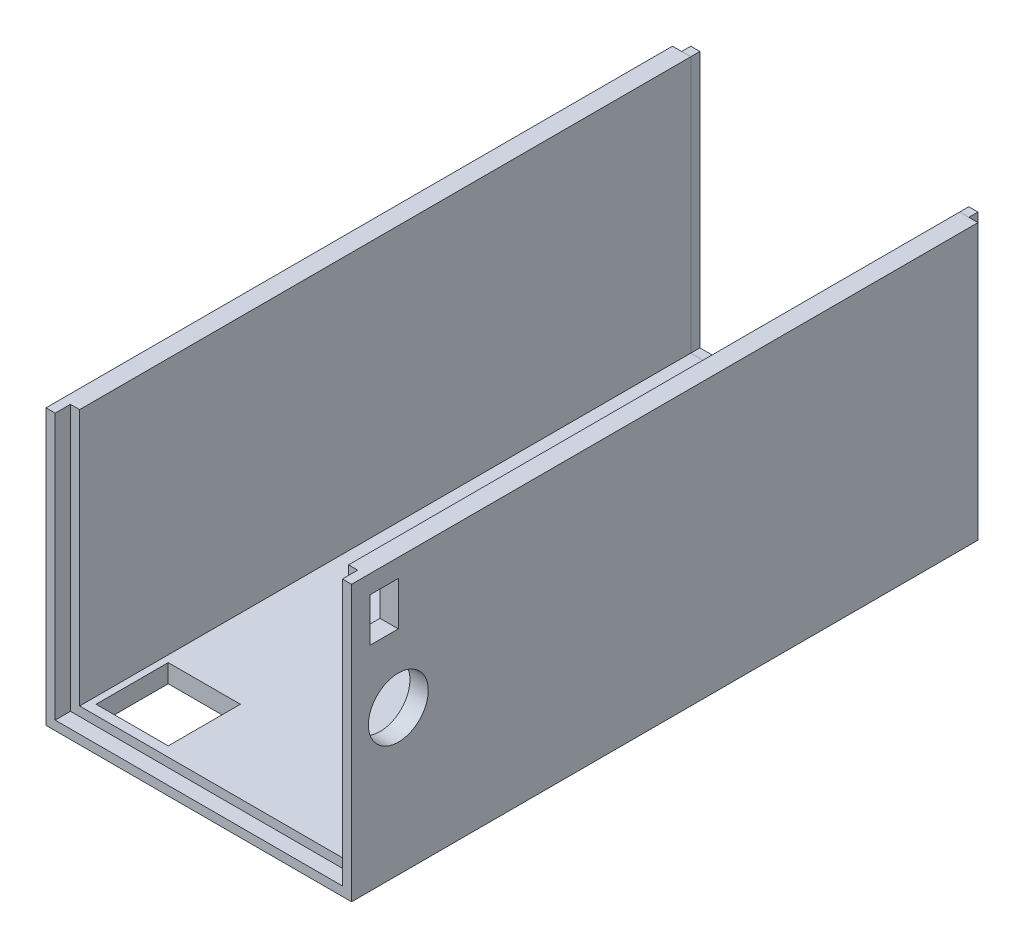
ISO-10303-21;
HEADER;
FILE_DESCRIPTION(('STEP AP214'),'2;1');
FILE_NAME('part.step','',(''),(''),'','','');
FILE_SCHEMA(('AUTOMOTIVE_DESIGN { 1 0 10303 214 1 1 1 1 }'));
ENDSEC;
DATA;
#1=APPLICATION_CONTEXT('core data for automotive mechanical design processes');
#2=APPLICATION_PROTOCOL_DEFINITION('international standard','automotive_design',2000,#1);
#3=PRODUCT_CONTEXT('',#1,'mechanical');
#4=PRODUCT('Part','Part','',(#3));
#5=PRODUCT_RELATED_PRODUCT_CATEGORY('part','',(#4));
#6=PRODUCT_DEFINITION_FORMATION('','',#4);
#7=PRODUCT_DEFINITION_CONTEXT('part definition',#1,'design');
#8=PRODUCT_DEFINITION('design','',#6,#7);
#9=PRODUCT_DEFINITION_SHAPE('','',#8);
#10=(LENGTH_UNIT() NAMED_UNIT(*) SI_UNIT(.MILLI.,.METRE.));
#11=(NAMED_UNIT(*) PLANE_ANGLE_UNIT() SI_UNIT($,.RADIAN.));
#12=(NAMED_UNIT(*) SI_UNIT($,.STERADIAN.) SOLID_ANGLE_UNIT());
#13=UNCERTAINTY_MEASURE_WITH_UNIT(LENGTH_MEASURE(1.E-05),#10,'distance_accuracy_value','');
#14=(GEOMETRIC_REPRESENTATION_CONTEXT(3) GLOBAL_UNCERTAINTY_ASSIGNED_CONTEXT((#13)) GLOBAL_UNIT_ASSIGNED_CONTEXT((#10,
#11,#12)) REPRESENTATION_CONTEXT('',''));
#15=CARTESIAN_POINT('',(0.,0.,0.));
#16=DIRECTION('',(0.,0.,1.));
#17=DIRECTION('',(1.,0.,0.));
#18=AXIS2_PLACEMENT_3D('',#15,#16,#17);
#19=CARTESIAN_POINT('',(-50.,87.,103.));
#20=DIRECTION('',(0.,-1.,0.));
#21=DIRECTION('',(1.,0.,0.));
#22=AXIS2_PLACEMENT_3D('',#19,#20,#21);
#23=PLANE('',#22);
#24=DIRECTION('',(-1.,0.,0.));
#25=VECTOR('',#24,1.);
#26=CARTESIAN_POINT('',(-50.,87.,3.));
#27=LINE('',#26,#25);
#28=CARTESIAN_POINT('',(-44.,87.,3.));
#29=VERTEX_POINT('',#28);
#30=CARTESIAN_POINT('',(-50.,87.,3.));
#31=VERTEX_POINT('',#30);
#32=EDGE_CURVE('E346',#29,#31,#27,.T.);
#33=ORIENTED_EDGE('',*,*,#32,.T.);
#34=DIRECTION('',(0.,0.,-1.));
#35=VECTOR('',#34,1.);
#36=CARTESIAN_POINT('',(-50.,87.,103.));
#37=LINE('',#36,#35);
#38=CARTESIAN_POINT('',(-50.,87.,208.));
#39=VERTEX_POINT('',#38);
#40=EDGE_CURVE('E384',#39,#31,#37,.T.);
#41=ORIENTED_EDGE('',*,*,#40,.F.);
#42=DIRECTION('',(-1.,0.,0.));
#43=VECTOR('',#42,1.);
#44=CARTESIAN_POINT('',(-50.,87.,208.));
#45=LINE('',#44,#43);
#46=CARTESIAN_POINT('',(-47.,87.,208.));
#47=VERTEX_POINT('',#46);
#48=EDGE_CURVE('E258',#47,#39,#45,.T.);
#49=ORIENTED_EDGE('',*,*,#48,.F.);
#50=DIRECTION('',(0.,0.,-1.));
#51=VECTOR('',#50,1.);
#52=CARTESIAN_POINT('',(-47.,87.,208.));
#53=LINE('',#52,#51);
#54=CARTESIAN_POINT('',(-47.,87.,203.));
#55=VERTEX_POINT('',#54);
#56=EDGE_CURVE('E261',#47,#55,#53,.T.);
#57=ORIENTED_EDGE('',*,*,#56,.T.);
#58=DIRECTION('',(-1.,0.,0.));
#59=VECTOR('',#58,1.);
#60=CARTESIAN_POINT('',(-50.,87.,203.));
#61=LINE('',#60,#59);
#62=CARTESIAN_POINT('',(-44.,87.,203.));
#63=VERTEX_POINT('',#62);
#64=EDGE_CURVE('E327',#63,#55,#61,.T.);
#65=ORIENTED_EDGE('',*,*,#64,.F.);
#66=DIRECTION('',(0.,0.,-1.));
#67=VECTOR('',#66,1.);
#68=CARTESIAN_POINT('',(-44.,87.,103.));
#69=LINE('',#68,#67);
#70=EDGE_CURVE('E363',#63,#29,#69,.T.);
#71=ORIENTED_EDGE('',*,*,#70,.T.);
#72=EDGE_LOOP('',(#33,#41,#49,#57,#65,#71));
#73=FACE_BOUND('',#72,.T.);
#74=ADVANCED_FACE('F48',(#73),#23,.F.);
#75=CARTESIAN_POINT('',(-50.,-2.99999999999999,103.));
#76=DIRECTION('',(1.,0.,0.));
#77=DIRECTION('',(0.,0.,-1.));
#78=AXIS2_PLACEMENT_3D('',#75,#76,#77);
#79=PLANE('',#78);
#80=DIRECTION('',(0.,-1.,0.));
#81=VECTOR('',#80,1.);
#82=CARTESIAN_POINT('',(-50.,-2.99999999999999,3.));
#83=LINE('',#82,#81);
#84=CARTESIAN_POINT('',(-50.,-2.99999999999999,3.));
#85=VERTEX_POINT('',#84);
#86=EDGE_CURVE('E349',#31,#85,#83,.T.);
#87=ORIENTED_EDGE('',*,*,#86,.T.);
#88=DIRECTION('',(0.,0.,-1.));
#89=VECTOR('',#88,1.);
#90=CARTESIAN_POINT('',(-50.,-2.99999999999999,103.));
#91=LINE('',#90,#89);
#92=CARTESIAN_POINT('',(-50.,-2.99999999999999,208.));
#93=VERTEX_POINT('',#92);
#94=EDGE_CURVE('E381',#93,#85,#91,.T.);
#95=ORIENTED_EDGE('',*,*,#94,.F.);
#96=DIRECTION('',(0.,-1.,0.));
#97=VECTOR('',#96,1.);
#98=CARTESIAN_POINT('',(-50.,-2.99999999999999,208.));
#99=LINE('',#98,#97);
#100=EDGE_CURVE('E240',#39,#93,#99,.T.);
#101=ORIENTED_EDGE('',*,*,#100,.F.);
#102=ORIENTED_EDGE('',*,*,#40,.T.);
#103=EDGE_LOOP('',(#87,#95,#101,#102));
#104=FACE_BOUND('',#103,.T.);
#105=ADVANCED_FACE('F424',(#104),#79,.F.);
#106=CARTESIAN_POINT('',(50.,-2.99999999999998,103.));
#107=DIRECTION('',(0.,1.,0.));
#108=DIRECTION('',(-1.,0.,0.));
#109=AXIS2_PLACEMENT_3D('',#106,#107,#108);
#110=PLANE('',#109);
#111=DIRECTION('',(-1.,0.,0.));
#112=VECTOR('',#111,1.);
#113=CARTESIAN_POINT('',(-41.8,-2.99999999999999,199.8));
#114=LINE('',#113,#112);
#115=CARTESIAN_POINT('',(-18.2,-2.99999999999999,199.8));
#116=VERTEX_POINT('',#115);
#117=CARTESIAN_POINT('',(-41.8,-2.99999999999999,199.8));
#118=VERTEX_POINT('',#117);
#119=EDGE_CURVE('E283',#116,#118,#114,.T.);
#120=ORIENTED_EDGE('',*,*,#119,.F.);
#121=DIRECTION('',(0.,0.,1.));
#122=VECTOR('',#121,1.);
#123=CARTESIAN_POINT('',(-18.2,-2.99999999999999,199.8));
#124=LINE('',#123,#122);
#125=CARTESIAN_POINT('',(-18.2,-2.99999999999999,176.2));
#126=VERTEX_POINT('',#125);
#127=EDGE_CURVE('E281',#126,#116,#124,.T.);
#128=ORIENTED_EDGE('',*,*,#127,.F.);
#129=DIRECTION('',(1.,0.,0.));
#130=VECTOR('',#129,1.);
#131=CARTESIAN_POINT('',(-41.8,-2.99999999999999,176.2));
#132=LINE('',#131,#130);
#133=CARTESIAN_POINT('',(-41.8,-2.99999999999999,176.2));
#134=VERTEX_POINT('',#133);
#135=EDGE_CURVE('E289',#134,#126,#132,.T.);
#136=ORIENTED_EDGE('',*,*,#135,.F.);
#137=DIRECTION('',(0.,0.,-1.));
#138=VECTOR('',#137,1.);
#139=CARTESIAN_POINT('',(-41.8,-2.99999999999999,199.8));
#140=LINE('',#139,#138);
#141=EDGE_CURVE('E286',#118,#134,#140,.T.);
#142=ORIENTED_EDGE('',*,*,#141,.F.);
#143=EDGE_LOOP('',(#120,#128,#136,#142));
#144=FACE_BOUND('',#143,.T.);
#145=DIRECTION('',(1.,0.,0.));
#146=VECTOR('',#145,1.);
#147=CARTESIAN_POINT('',(-6.25,-2.99999999999999,114.5));
#148=LINE('',#147,#146);
#149=CARTESIAN_POINT('',(-6.25,-2.99999999999999,114.5));
#150=VERTEX_POINT('',#149);
#151=CARTESIAN_POINT('',(6.25,-2.99999999999999,114.5));
#152=VERTEX_POINT('',#151);
#153=EDGE_CURVE('E312',#150,#152,#148,.T.);
#154=ORIENTED_EDGE('',*,*,#153,.T.);
#155=DIRECTION('',(0.,0.,-1.));
#156=VECTOR('',#155,1.);
#157=CARTESIAN_POINT('',(6.25,-2.99999999999999,114.5));
#158=LINE('',#157,#156);
#159=CARTESIAN_POINT('',(6.25,-2.99999999999999,91.5));
#160=VERTEX_POINT('',#159);
#161=EDGE_CURVE('E302',#152,#160,#158,.T.);
#162=ORIENTED_EDGE('',*,*,#161,.T.);
#163=DIRECTION('',(-1.,0.,0.));
#164=VECTOR('',#163,1.);
#165=CARTESIAN_POINT('',(-6.25,-2.99999999999999,91.5));
#166=LINE('',#165,#164);
#167=CARTESIAN_POINT('',(-6.25,-2.99999999999998,91.5));
#168=VERTEX_POINT('',#167);
#169=EDGE_CURVE('E305',#160,#168,#166,.T.);
#170=ORIENTED_EDGE('',*,*,#169,.T.);
#171=DIRECTION('',(0.,0.,1.));
#172=VECTOR('',#171,1.);
#173=CARTESIAN_POINT('',(-6.25,-2.99999999999999,114.5));
#174=LINE('',#173,#172);
#175=EDGE_CURVE('E309',#168,#150,#174,.T.);
#176=ORIENTED_EDGE('',*,*,#175,.T.);
#177=EDGE_LOOP('',(#154,#162,#170,#176));
#178=FACE_BOUND('',#177,.T.);
#179=DIRECTION('',(1.,0.,0.));
#180=VECTOR('',#179,1.);
#181=CARTESIAN_POINT('',(50.,-2.99999999999998,3.));
#182=LINE('',#181,#180);
#183=CARTESIAN_POINT('',(50.,-2.99999999999998,3.));
#184=VERTEX_POINT('',#183);
#185=EDGE_CURVE('E351',#85,#184,#182,.T.);
#186=ORIENTED_EDGE('',*,*,#185,.T.);
#187=DIRECTION('',(0.,0.,-1.));
#188=VECTOR('',#187,1.);
#189=CARTESIAN_POINT('',(50.,-2.99999999999998,103.));
#190=LINE('',#189,#188);
#191=CARTESIAN_POINT('',(50.,-2.99999999999998,208.));
#192=VERTEX_POINT('',#191);
#193=EDGE_CURVE('E378',#192,#184,#190,.T.);
#194=ORIENTED_EDGE('',*,*,#193,.F.);
#195=DIRECTION('',(1.,0.,0.));
#196=VECTOR('',#195,1.);
#197=CARTESIAN_POINT('',(50.,-2.99999999999998,208.));
#198=LINE('',#197,#196);
#199=EDGE_CURVE('E243',#93,#192,#198,.T.);
#200=ORIENTED_EDGE('',*,*,#199,.F.);
#201=ORIENTED_EDGE('',*,*,#94,.T.);
#202=EDGE_LOOP('',(#186,#194,#200,#201));
#203=FACE_BOUND('',#202,.T.);
#204=ADVANCED_FACE('F429',(#144,#178,#203),#110,.F.);
#205=CARTESIAN_POINT('',(50.,87.,103.));
#206=DIRECTION('',(-1.,0.,0.));
#207=DIRECTION('',(0.,-1.,0.));
#208=AXIS2_PLACEMENT_3D('',#205,#206,#207);
#209=PLANE('',#208);
#210=DIRECTION('',(0.,0.,-1.));
#211=VECTOR('',#210,1.);
#212=CARTESIAN_POINT('',(50.,66.7,202.));
#213=LINE('',#212,#211);
#214=CARTESIAN_POINT('',(50.,66.7,202.));
#215=VERTEX_POINT('',#214);
#216=CARTESIAN_POINT('',(50.,66.7,192.7));
#217=VERTEX_POINT('',#216);
#218=EDGE_CURVE('E220',#215,#217,#213,.T.);
#219=ORIENTED_EDGE('',*,*,#218,.F.);
#220=DIRECTION('',(0.,-1.,0.));
#221=VECTOR('',#220,1.);
#222=CARTESIAN_POINT('',(50.,81.,202.));
#223=LINE('',#222,#221);
#224=CARTESIAN_POINT('',(50.,81.,202.));
#225=VERTEX_POINT('',#224);
#226=EDGE_CURVE('E62',#225,#215,#223,.T.);
#227=ORIENTED_EDGE('',*,*,#226,.F.);
#228=DIRECTION('',(0.,0.,1.));
#229=VECTOR('',#228,1.);
#230=CARTESIAN_POINT('',(50.,81.,202.));
#231=LINE('',#230,#229);
#232=CARTESIAN_POINT('',(50.,81.,192.7));
#233=VERTEX_POINT('',#232);
#234=EDGE_CURVE('E227',#233,#225,#231,.T.);
#235=ORIENTED_EDGE('',*,*,#234,.F.);
#236=DIRECTION('',(0.,1.,0.));
#237=VECTOR('',#236,1.);
#238=CARTESIAN_POINT('',(50.,81.,192.7));
#239=LINE('',#238,#237);
#240=EDGE_CURVE('E211',#217,#233,#239,.T.);
#241=ORIENTED_EDGE('',*,*,#240,.F.);
#242=EDGE_LOOP('',(#219,#227,#235,#241));
#243=FACE_BOUND('',#242,.T.);
#244=CARTESIAN_POINT('',(50.,44.4,192.7));
#245=DIRECTION('',(1.,0.,0.));
#246=DIRECTION('',(0.,1.,0.));
#247=AXIS2_PLACEMENT_3D('',#244,#245,#246);
#248=CIRCLE('',#247,9.79999999999999);
#249=CARTESIAN_POINT('',(50.,54.2,192.7));
#250=VERTEX_POINT('',#249);
#251=EDGE_CURVE('E237',#250,#250,#248,.T.);
#252=ORIENTED_EDGE('',*,*,#251,.F.);
#253=EDGE_LOOP('',(#252));
#254=FACE_BOUND('',#253,.T.);
#255=DIRECTION('',(0.,1.,0.));
#256=VECTOR('',#255,1.);
#257=CARTESIAN_POINT('',(50.,87.,3.));
#258=LINE('',#257,#256);
#259=CARTESIAN_POINT('',(50.,87.,3.));
#260=VERTEX_POINT('',#259);
#261=EDGE_CURVE('E353',#184,#260,#258,.T.);
#262=ORIENTED_EDGE('',*,*,#261,.T.);
#263=DIRECTION('',(0.,0.,-1.));
#264=VECTOR('',#263,1.);
#265=CARTESIAN_POINT('',(50.,87.,103.));
#266=LINE('',#265,#264);
#267=CARTESIAN_POINT('',(50.,87.,208.));
#268=VERTEX_POINT('',#267);
#269=EDGE_CURVE('E375',#268,#260,#266,.T.);
#270=ORIENTED_EDGE('',*,*,#269,.F.);
#271=DIRECTION('',(0.,1.,0.));
#272=VECTOR('',#271,1.);
#273=CARTESIAN_POINT('',(50.,87.,208.));
#274=LINE('',#273,#272);
#275=EDGE_CURVE('E247',#192,#268,#274,.T.);
#276=ORIENTED_EDGE('',*,*,#275,.F.);
#277=ORIENTED_EDGE('',*,*,#193,.T.);
#278=EDGE_LOOP('',(#262,#270,#276,#277));
#279=FACE_BOUND('',#278,.T.);
#280=ADVANCED_FACE('F224',(#243,#254,#279),#209,.F.);
#281=CARTESIAN_POINT('',(44.,87.,103.));
#282=DIRECTION('',(0.,-1.,0.));
#283=DIRECTION('',(1.,0.,0.));
#284=AXIS2_PLACEMENT_3D('',#281,#282,#283);
#285=PLANE('',#284);
#286=DIRECTION('',(-1.,0.,0.));
#287=VECTOR('',#286,1.);
#288=CARTESIAN_POINT('',(44.,87.,3.));
#289=LINE('',#288,#287);
#290=CARTESIAN_POINT('',(44.,87.,3.));
#291=VERTEX_POINT('',#290);
#292=EDGE_CURVE('E355',#260,#291,#289,.T.);
#293=ORIENTED_EDGE('',*,*,#292,.T.);
#294=DIRECTION('',(0.,0.,-1.));
#295=VECTOR('',#294,1.);
#296=CARTESIAN_POINT('',(44.,87.,103.));
#297=LINE('',#296,#295);
#298=CARTESIAN_POINT('',(44.,87.,203.));
#299=VERTEX_POINT('',#298);
#300=EDGE_CURVE('E372',#299,#291,#297,.T.);
#301=ORIENTED_EDGE('',*,*,#300,.F.);
#302=DIRECTION('',(-1.,0.,0.));
#303=VECTOR('',#302,1.);
#304=CARTESIAN_POINT('',(44.,87.,203.));
#305=LINE('',#304,#303);
#306=CARTESIAN_POINT('',(47.,87.,203.));
#307=VERTEX_POINT('',#306);
#308=EDGE_CURVE('E335',#307,#299,#305,.T.);
#309=ORIENTED_EDGE('',*,*,#308,.F.);
#310=DIRECTION('',(0.,0.,-1.));
#311=VECTOR('',#310,1.);
#312=CARTESIAN_POINT('',(47.,87.,208.));
#313=LINE('',#312,#311);
#314=CARTESIAN_POINT('',(47.,87.,208.));
#315=VERTEX_POINT('',#314);
#316=EDGE_CURVE('E278',#315,#307,#313,.T.);
#317=ORIENTED_EDGE('',*,*,#316,.F.);
#318=DIRECTION('',(-1.,0.,0.));
#319=VECTOR('',#318,1.);
#320=CARTESIAN_POINT('',(47.,87.,208.));
#321=LINE('',#320,#319);
#322=EDGE_CURVE('E250',#268,#315,#321,.T.);
#323=ORIENTED_EDGE('',*,*,#322,.F.);
#324=ORIENTED_EDGE('',*,*,#269,.T.);
#325=EDGE_LOOP('',(#293,#301,#309,#317,#323,#324));
#326=FACE_BOUND('',#325,.T.);
#327=ADVANCED_FACE('F462',(#326),#285,.F.);
#328=CARTESIAN_POINT('',(44.,3.00000000000002,103.));
#329=DIRECTION('',(1.,0.,0.));
#330=DIRECTION('',(0.,1.,0.));
#331=AXIS2_PLACEMENT_3D('',#328,#329,#330);
#332=PLANE('',#331);
#333=DIRECTION('',(0.,0.,1.));
#334=VECTOR('',#333,1.);
#335=CARTESIAN_POINT('',(44.,81.,103.));
#336=LINE('',#335,#334);
#337=CARTESIAN_POINT('',(44.,81.,192.7));
#338=VERTEX_POINT('',#337);
#339=CARTESIAN_POINT('',(44.,81.,202.));
#340=VERTEX_POINT('',#339);
#341=EDGE_CURVE('E55',#338,#340,#336,.T.);
#342=ORIENTED_EDGE('',*,*,#341,.T.);
#343=DIRECTION('',(0.,-1.,0.));
#344=VECTOR('',#343,1.);
#345=CARTESIAN_POINT('',(44.,3.00000000000002,202.));
#346=LINE('',#345,#344);
#347=CARTESIAN_POINT('',(44.,66.7,202.));
#348=VERTEX_POINT('',#347);
#349=EDGE_CURVE('E12',#340,#348,#346,.T.);
#350=ORIENTED_EDGE('',*,*,#349,.T.);
#351=DIRECTION('',(0.,0.,-1.));
#352=VECTOR('',#351,1.);
#353=CARTESIAN_POINT('',(44.,66.7,103.));
#354=LINE('',#353,#352);
#355=CARTESIAN_POINT('',(44.,66.7,192.7));
#356=VERTEX_POINT('',#355);
#357=EDGE_CURVE('E399',#348,#356,#354,.T.);
#358=ORIENTED_EDGE('',*,*,#357,.T.);
#359=DIRECTION('',(0.,1.,0.));
#360=VECTOR('',#359,1.);
#361=CARTESIAN_POINT('',(44.,3.00000000000002,192.7));
#362=LINE('',#361,#360);
#363=EDGE_CURVE('E214',#356,#338,#362,.T.);
#364=ORIENTED_EDGE('',*,*,#363,.T.);
#365=EDGE_LOOP('',(#342,#350,#358,#364));
#366=FACE_BOUND('',#365,.T.);
#367=CARTESIAN_POINT('',(44.,44.4,192.7));
#368=DIRECTION('',(1.,0.,0.));
#369=DIRECTION('',(0.,1.,0.));
#370=AXIS2_PLACEMENT_3D('',#367,#368,#369);
#371=CIRCLE('',#370,9.79999999999999);
#372=CARTESIAN_POINT('',(44.,54.2,192.7));
#373=VERTEX_POINT('',#372);
#374=EDGE_CURVE('E234',#373,#373,#371,.T.);
#375=ORIENTED_EDGE('',*,*,#374,.T.);
#376=EDGE_LOOP('',(#375));
#377=FACE_BOUND('',#376,.T.);
#378=DIRECTION('',(0.,-1.,0.));
#379=VECTOR('',#378,1.);
#380=CARTESIAN_POINT('',(44.,3.00000000000002,3.));
#381=LINE('',#380,#379);
#382=CARTESIAN_POINT('',(44.,3.00000000000002,3.));
#383=VERTEX_POINT('',#382);
#384=EDGE_CURVE('E357',#291,#383,#381,.T.);
#385=ORIENTED_EDGE('',*,*,#384,.T.);
#386=DIRECTION('',(0.,0.,-1.));
#387=VECTOR('',#386,1.);
#388=CARTESIAN_POINT('',(44.,3.00000000000002,103.));
#389=LINE('',#388,#387);
#390=CARTESIAN_POINT('',(44.,3.00000000000002,203.));
#391=VERTEX_POINT('',#390);
#392=EDGE_CURVE('E369',#391,#383,#389,.T.);
#393=ORIENTED_EDGE('',*,*,#392,.F.);
#394=DIRECTION('',(0.,-1.,0.));
#395=VECTOR('',#394,1.);
#396=CARTESIAN_POINT('',(44.,3.00000000000002,203.));
#397=LINE('',#396,#395);
#398=EDGE_CURVE('E337',#299,#391,#397,.T.);
#399=ORIENTED_EDGE('',*,*,#398,.F.);
#400=ORIENTED_EDGE('',*,*,#300,.T.);
#401=EDGE_LOOP('',(#385,#393,#399,#400));
#402=FACE_BOUND('',#401,.T.);
#403=ADVANCED_FACE('F405',(#366,#377,#402),#332,.F.);
#404=CARTESIAN_POINT('',(-44.,3.,103.));
#405=DIRECTION('',(0.,-1.,0.));
#406=DIRECTION('',(1.,0.,0.));
#407=AXIS2_PLACEMENT_3D('',#404,#405,#406);
#408=PLANE('',#407);
#409=DIRECTION('',(1.,0.,0.));
#410=VECTOR('',#409,1.);
#411=CARTESIAN_POINT('',(-44.,3.,176.2));
#412=LINE('',#411,#410);
#413=CARTESIAN_POINT('',(-41.8,3.,176.2));
#414=VERTEX_POINT('',#413);
#415=CARTESIAN_POINT('',(-18.2,3.00000000000001,176.2));
#416=VERTEX_POINT('',#415);
#417=EDGE_CURVE('E393',#414,#416,#412,.T.);
#418=ORIENTED_EDGE('',*,*,#417,.T.);
#419=DIRECTION('',(0.,0.,1.));
#420=VECTOR('',#419,1.);
#421=CARTESIAN_POINT('',(-18.2,3.00000000000001,103.));
#422=LINE('',#421,#420);
#423=CARTESIAN_POINT('',(-18.2,3.00000000000001,199.8));
#424=VERTEX_POINT('',#423);
#425=EDGE_CURVE('E396',#416,#424,#422,.T.);
#426=ORIENTED_EDGE('',*,*,#425,.T.);
#427=DIRECTION('',(-1.,0.,0.));
#428=VECTOR('',#427,1.);
#429=CARTESIAN_POINT('',(-44.,3.,199.8));
#430=LINE('',#429,#428);
#431=CARTESIAN_POINT('',(-41.8,3.,199.8));
#432=VERTEX_POINT('',#431);
#433=EDGE_CURVE('E387',#424,#432,#430,.T.);
#434=ORIENTED_EDGE('',*,*,#433,.T.);
#435=DIRECTION('',(0.,0.,-1.));
#436=VECTOR('',#435,1.);
#437=CARTESIAN_POINT('',(-41.8,3.,103.));
#438=LINE('',#437,#436);
#439=EDGE_CURVE('E390',#432,#414,#438,.T.);
#440=ORIENTED_EDGE('',*,*,#439,.T.);
#441=EDGE_LOOP('',(#418,#426,#434,#440));
#442=FACE_BOUND('',#441,.T.);
#443=DIRECTION('',(-1.,0.,0.));
#444=VECTOR('',#443,1.);
#445=CARTESIAN_POINT('',(-6.25,3.00000000000001,91.5));
#446=LINE('',#445,#444);
#447=CARTESIAN_POINT('',(6.25000000000001,3.00000000000001,91.5));
#448=VERTEX_POINT('',#447);
#449=CARTESIAN_POINT('',(-6.25,3.00000000000001,91.5));
#450=VERTEX_POINT('',#449);
#451=EDGE_CURVE('E317',#448,#450,#446,.T.);
#452=ORIENTED_EDGE('',*,*,#451,.F.);
#453=DIRECTION('',(0.,0.,-1.));
#454=VECTOR('',#453,1.);
#455=CARTESIAN_POINT('',(6.25,3.00000000000001,114.5));
#456=LINE('',#455,#454);
#457=CARTESIAN_POINT('',(6.25,3.00000000000001,114.5));
#458=VERTEX_POINT('',#457);
#459=EDGE_CURVE('E295',#458,#448,#456,.T.);
#460=ORIENTED_EDGE('',*,*,#459,.F.);
#461=DIRECTION('',(1.,0.,0.));
#462=VECTOR('',#461,1.);
#463=CARTESIAN_POINT('',(-6.25,3.00000000000001,114.5));
#464=LINE('',#463,#462);
#465=CARTESIAN_POINT('',(-6.25,3.00000000000001,114.5));
#466=VERTEX_POINT('',#465);
#467=EDGE_CURVE('E306',#466,#458,#464,.T.);
#468=ORIENTED_EDGE('',*,*,#467,.F.);
#469=DIRECTION('',(0.,0.,1.));
#470=VECTOR('',#469,1.);
#471=CARTESIAN_POINT('',(-6.25,3.00000000000001,114.5));
#472=LINE('',#471,#470);
#473=EDGE_CURVE('E320',#450,#466,#472,.T.);
#474=ORIENTED_EDGE('',*,*,#473,.F.);
#475=EDGE_LOOP('',(#452,#460,#468,#474));
#476=FACE_BOUND('',#475,.T.);
#477=DIRECTION('',(-1.,0.,0.));
#478=VECTOR('',#477,1.);
#479=CARTESIAN_POINT('',(-44.,3.,3.));
#480=LINE('',#479,#478);
#481=CARTESIAN_POINT('',(-44.,3.,3.));
#482=VERTEX_POINT('',#481);
#483=EDGE_CURVE('E359',#383,#482,#480,.T.);
#484=ORIENTED_EDGE('',*,*,#483,.T.);
#485=DIRECTION('',(0.,0.,-1.));
#486=VECTOR('',#485,1.);
#487=CARTESIAN_POINT('',(-44.,3.,103.));
#488=LINE('',#487,#486);
#489=CARTESIAN_POINT('',(-44.,3.,203.));
#490=VERTEX_POINT('',#489);
#491=EDGE_CURVE('E366',#490,#482,#488,.T.);
#492=ORIENTED_EDGE('',*,*,#491,.F.);
#493=DIRECTION('',(-1.,0.,0.));
#494=VECTOR('',#493,1.);
#495=CARTESIAN_POINT('',(-44.,3.,203.));
#496=LINE('',#495,#494);
#497=EDGE_CURVE('E340',#391,#490,#496,.T.);
#498=ORIENTED_EDGE('',*,*,#497,.F.);
#499=ORIENTED_EDGE('',*,*,#392,.T.);
#500=EDGE_LOOP('',(#484,#492,#498,#499));
#501=FACE_BOUND('',#500,.T.);
#502=ADVANCED_FACE('F471',(#442,#476,#501),#408,.F.);
#503=CARTESIAN_POINT('',(-44.,87.,103.));
#504=DIRECTION('',(-1.,0.,0.));
#505=DIRECTION('',(0.,0.,1.));
#506=AXIS2_PLACEMENT_3D('',#503,#504,#505);
#507=PLANE('',#506);
#508=DIRECTION('',(0.,1.,0.));
#509=VECTOR('',#508,1.);
#510=CARTESIAN_POINT('',(-44.,87.,3.));
#511=LINE('',#510,#509);
#512=EDGE_CURVE('E361',#482,#29,#511,.T.);
#513=ORIENTED_EDGE('',*,*,#512,.T.);
#514=ORIENTED_EDGE('',*,*,#70,.F.);
#515=DIRECTION('',(0.,1.,0.));
#516=VECTOR('',#515,1.);
#517=CARTESIAN_POINT('',(-44.,87.,203.));
#518=LINE('',#517,#516);
#519=EDGE_CURVE('E343',#490,#63,#518,.T.);
#520=ORIENTED_EDGE('',*,*,#519,.F.);
#521=ORIENTED_EDGE('',*,*,#491,.T.);
#522=EDGE_LOOP('',(#513,#514,#520,#521));
#523=FACE_BOUND('',#522,.T.);
#524=ADVANCED_FACE('F473',(#523),#507,.F.);
#525=CARTESIAN_POINT('',(0.,0.,3.));
#526=DIRECTION('',(0.,0.,-1.));
#527=DIRECTION('',(-1.,0.,0.));
#528=AXIS2_PLACEMENT_3D('',#525,#526,#527);
#529=PLANE('',#528);
#530=ORIENTED_EDGE('',*,*,#32,.F.);
#531=ORIENTED_EDGE('',*,*,#512,.F.);
#532=ORIENTED_EDGE('',*,*,#483,.F.);
#533=ORIENTED_EDGE('',*,*,#384,.F.);
#534=ORIENTED_EDGE('',*,*,#292,.F.);
#535=ORIENTED_EDGE('',*,*,#261,.F.);
#536=ORIENTED_EDGE('',*,*,#185,.F.);
#537=ORIENTED_EDGE('',*,*,#86,.F.);
#538=EDGE_LOOP('',(#530,#531,#532,#533,#534,#535,#536,#537));
#539=FACE_BOUND('',#538,.T.);
#540=ADVANCED_FACE('F436',(#539),#529,.T.);
#541=CARTESIAN_POINT('',(0.,0.,203.));
#542=DIRECTION('',(0.,0.,1.));
#543=DIRECTION('',(-1.,0.,0.));
#544=AXIS2_PLACEMENT_3D('',#541,#542,#543);
#545=PLANE('',#544);
#546=DIRECTION('',(0.,1.,0.));
#547=VECTOR('',#546,1.);
#548=CARTESIAN_POINT('',(-47.,87.,203.));
#549=LINE('',#548,#547);
#550=CARTESIAN_POINT('',(-47.,0.,203.));
#551=VERTEX_POINT('',#550);
#552=EDGE_CURVE('E244',#551,#55,#549,.T.);
#553=ORIENTED_EDGE('',*,*,#552,.F.);
#554=DIRECTION('',(-1.,0.,0.));
#555=VECTOR('',#554,1.);
#556=CARTESIAN_POINT('',(-47.,0.,203.));
#557=LINE('',#556,#555);
#558=CARTESIAN_POINT('',(47.,0.,203.));
#559=VERTEX_POINT('',#558);
#560=EDGE_CURVE('E265',#559,#551,#557,.T.);
#561=ORIENTED_EDGE('',*,*,#560,.F.);
#562=DIRECTION('',(0.,-1.,0.));
#563=VECTOR('',#562,1.);
#564=CARTESIAN_POINT('',(47.,0.,203.));
#565=LINE('',#564,#563);
#566=EDGE_CURVE('E262',#307,#559,#565,.T.);
#567=ORIENTED_EDGE('',*,*,#566,.F.);
#568=ORIENTED_EDGE('',*,*,#308,.T.);
#569=ORIENTED_EDGE('',*,*,#398,.T.);
#570=ORIENTED_EDGE('',*,*,#497,.T.);
#571=ORIENTED_EDGE('',*,*,#519,.T.);
#572=ORIENTED_EDGE('',*,*,#64,.T.);
#573=EDGE_LOOP('',(#553,#561,#567,#568,#569,#570,#571,#572));
#574=FACE_BOUND('',#573,.T.);
#575=ADVANCED_FACE('F450',(#574),#545,.T.);
#576=CARTESIAN_POINT('',(6.25,-2.99999999999999,114.5));
#577=DIRECTION('',(1.,0.,0.));
#578=DIRECTION('',(0.,1.,0.));
#579=AXIS2_PLACEMENT_3D('',#576,#577,#578);
#580=PLANE('',#579);
#581=ORIENTED_EDGE('',*,*,#459,.T.);
#582=DIRECTION('',(0.,1.,0.));
#583=VECTOR('',#582,1.);
#584=CARTESIAN_POINT('',(6.25,-2.99999999999999,91.5));
#585=LINE('',#584,#583);
#586=EDGE_CURVE('E315',#160,#448,#585,.T.);
#587=ORIENTED_EDGE('',*,*,#586,.F.);
#588=ORIENTED_EDGE('',*,*,#161,.F.);
#589=DIRECTION('',(0.,1.,0.));
#590=VECTOR('',#589,1.);
#591=CARTESIAN_POINT('',(6.25,-2.99999999999999,114.5));
#592=LINE('',#591,#590);
#593=EDGE_CURVE('E325',#152,#458,#592,.T.);
#594=ORIENTED_EDGE('',*,*,#593,.T.);
#595=EDGE_LOOP('',(#581,#587,#588,#594));
#596=FACE_BOUND('',#595,.T.);
#597=ADVANCED_FACE('F508',(#596),#580,.F.);
#598=CARTESIAN_POINT('',(-6.25,-2.99999999999999,114.5));
#599=DIRECTION('',(0.,0.,1.));
#600=DIRECTION('',(1.,0.,0.));
#601=AXIS2_PLACEMENT_3D('',#598,#599,#600);
#602=PLANE('',#601);
#603=ORIENTED_EDGE('',*,*,#467,.T.);
#604=ORIENTED_EDGE('',*,*,#593,.F.);
#605=ORIENTED_EDGE('',*,*,#153,.F.);
#606=DIRECTION('',(0.,1.,0.));
#607=VECTOR('',#606,1.);
#608=CARTESIAN_POINT('',(-6.25,-2.99999999999999,114.5));
#609=LINE('',#608,#607);
#610=EDGE_CURVE('E328',#150,#466,#609,.T.);
#611=ORIENTED_EDGE('',*,*,#610,.T.);
#612=EDGE_LOOP('',(#603,#604,#605,#611));
#613=FACE_BOUND('',#612,.T.);
#614=ADVANCED_FACE('F504',(#613),#602,.F.);
#615=CARTESIAN_POINT('',(-6.25,-2.99999999999999,114.5));
#616=DIRECTION('',(-1.,0.,0.));
#617=DIRECTION('',(0.,-1.,0.));
#618=AXIS2_PLACEMENT_3D('',#615,#616,#617);
#619=PLANE('',#618);
#620=ORIENTED_EDGE('',*,*,#473,.T.);
#621=ORIENTED_EDGE('',*,*,#610,.F.);
#622=ORIENTED_EDGE('',*,*,#175,.F.);
#623=DIRECTION('',(0.,1.,0.));
#624=VECTOR('',#623,1.);
#625=CARTESIAN_POINT('',(-6.25,-2.99999999999999,91.5));
#626=LINE('',#625,#624);
#627=EDGE_CURVE('E330',#168,#450,#626,.T.);
#628=ORIENTED_EDGE('',*,*,#627,.T.);
#629=EDGE_LOOP('',(#620,#621,#622,#628));
#630=FACE_BOUND('',#629,.T.);
#631=ADVANCED_FACE('F516',(#630),#619,.F.);
#632=CARTESIAN_POINT('',(-6.25,-2.99999999999999,91.5));
#633=DIRECTION('',(0.,0.,-1.));
#634=DIRECTION('',(-1.,0.,0.));
#635=AXIS2_PLACEMENT_3D('',#632,#633,#634);
#636=PLANE('',#635);
#637=ORIENTED_EDGE('',*,*,#451,.T.);
#638=ORIENTED_EDGE('',*,*,#627,.F.);
#639=ORIENTED_EDGE('',*,*,#169,.F.);
#640=ORIENTED_EDGE('',*,*,#586,.T.);
#641=EDGE_LOOP('',(#637,#638,#639,#640));
#642=FACE_BOUND('',#641,.T.);
#643=ADVANCED_FACE('F513',(#642),#636,.F.);
#644=CARTESIAN_POINT('',(-18.2,7.00000000000002,199.8));
#645=DIRECTION('',(1.,0.,0.));
#646=DIRECTION('',(0.,0.,-1.));
#647=AXIS2_PLACEMENT_3D('',#644,#645,#646);
#648=PLANE('',#647);
#649=DIRECTION('',(0.,-1.,0.));
#650=VECTOR('',#649,1.);
#651=CARTESIAN_POINT('',(-18.2,7.00000000000002,176.2));
#652=LINE('',#651,#650);
#653=EDGE_CURVE('E293',#416,#126,#652,.T.);
#654=ORIENTED_EDGE('',*,*,#653,.T.);
#655=ORIENTED_EDGE('',*,*,#127,.T.);
#656=DIRECTION('',(0.,-1.,0.));
#657=VECTOR('',#656,1.);
#658=CARTESIAN_POINT('',(-18.2,7.00000000000002,199.8));
#659=LINE('',#658,#657);
#660=EDGE_CURVE('E292',#424,#116,#659,.T.);
#661=ORIENTED_EDGE('',*,*,#660,.F.);
#662=ORIENTED_EDGE('',*,*,#425,.F.);
#663=EDGE_LOOP('',(#654,#655,#661,#662));
#664=FACE_BOUND('',#663,.T.);
#665=ADVANCED_FACE('F524',(#664),#648,.F.);
#666=CARTESIAN_POINT('',(-41.8,7.00000000000001,176.2));
#667=DIRECTION('',(0.,0.,-1.));
#668=DIRECTION('',(-1.,0.,0.));
#669=AXIS2_PLACEMENT_3D('',#666,#667,#668);
#670=PLANE('',#669);
#671=DIRECTION('',(0.,-1.,0.));
#672=VECTOR('',#671,1.);
#673=CARTESIAN_POINT('',(-41.8,7.00000000000001,176.2));
#674=LINE('',#673,#672);
#675=EDGE_CURVE('E296',#414,#134,#674,.T.);
#676=ORIENTED_EDGE('',*,*,#675,.T.);
#677=ORIENTED_EDGE('',*,*,#135,.T.);
#678=ORIENTED_EDGE('',*,*,#653,.F.);
#679=ORIENTED_EDGE('',*,*,#417,.F.);
#680=EDGE_LOOP('',(#676,#677,#678,#679));
#681=FACE_BOUND('',#680,.T.);
#682=ADVANCED_FACE('F573',(#681),#670,.F.);
#683=CARTESIAN_POINT('',(-41.8,7.00000000000001,199.8));
#684=DIRECTION('',(-1.,0.,0.));
#685=DIRECTION('',(0.,-1.,0.));
#686=AXIS2_PLACEMENT_3D('',#683,#684,#685);
#687=PLANE('',#686);
#688=DIRECTION('',(0.,-1.,0.));
#689=VECTOR('',#688,1.);
#690=CARTESIAN_POINT('',(-41.8,7.00000000000001,199.8));
#691=LINE('',#690,#689);
#692=EDGE_CURVE('E298',#432,#118,#691,.T.);
#693=ORIENTED_EDGE('',*,*,#692,.T.);
#694=ORIENTED_EDGE('',*,*,#141,.T.);
#695=ORIENTED_EDGE('',*,*,#675,.F.);
#696=ORIENTED_EDGE('',*,*,#439,.F.);
#697=EDGE_LOOP('',(#693,#694,#695,#696));
#698=FACE_BOUND('',#697,.T.);
#699=ADVANCED_FACE('F582',(#698),#687,.F.);
#700=CARTESIAN_POINT('',(-41.8,7.00000000000001,199.8));
#701=DIRECTION('',(0.,0.,1.));
#702=DIRECTION('',(1.,0.,0.));
#703=AXIS2_PLACEMENT_3D('',#700,#701,#702);
#704=PLANE('',#703);
#705=ORIENTED_EDGE('',*,*,#660,.T.);
#706=ORIENTED_EDGE('',*,*,#119,.T.);
#707=ORIENTED_EDGE('',*,*,#692,.F.);
#708=ORIENTED_EDGE('',*,*,#433,.F.);
#709=EDGE_LOOP('',(#705,#706,#707,#708));
#710=FACE_BOUND('',#709,.T.);
#711=ADVANCED_FACE('F592',(#710),#704,.F.);
#712=CARTESIAN_POINT('',(47.,0.,208.));
#713=DIRECTION('',(1.,0.,0.));
#714=DIRECTION('',(0.,0.,-1.));
#715=AXIS2_PLACEMENT_3D('',#712,#713,#714);
#716=PLANE('',#715);
#717=ORIENTED_EDGE('',*,*,#566,.T.);
#718=DIRECTION('',(0.,0.,-1.));
#719=VECTOR('',#718,1.);
#720=CARTESIAN_POINT('',(47.,0.,208.));
#721=LINE('',#720,#719);
#722=CARTESIAN_POINT('',(47.,0.,208.));
#723=VERTEX_POINT('',#722);
#724=EDGE_CURVE('E275',#723,#559,#721,.T.);
#725=ORIENTED_EDGE('',*,*,#724,.F.);
#726=DIRECTION('',(0.,-1.,0.));
#727=VECTOR('',#726,1.);
#728=CARTESIAN_POINT('',(47.,0.,208.));
#729=LINE('',#728,#727);
#730=EDGE_CURVE('E252',#315,#723,#729,.T.);
#731=ORIENTED_EDGE('',*,*,#730,.F.);
#732=ORIENTED_EDGE('',*,*,#316,.T.);
#733=EDGE_LOOP('',(#717,#725,#731,#732));
#734=FACE_BOUND('',#733,.T.);
#735=ADVANCED_FACE('F457',(#734),#716,.F.);
#736=CARTESIAN_POINT('',(-47.,0.,208.));
#737=DIRECTION('',(0.,-1.,0.));
#738=DIRECTION('',(0.,0.,-1.));
#739=AXIS2_PLACEMENT_3D('',#736,#737,#738);
#740=PLANE('',#739);
#741=ORIENTED_EDGE('',*,*,#560,.T.);
#742=DIRECTION('',(0.,0.,-1.));
#743=VECTOR('',#742,1.);
#744=CARTESIAN_POINT('',(-47.,0.,208.));
#745=LINE('',#744,#743);
#746=CARTESIAN_POINT('',(-47.,0.,208.));
#747=VERTEX_POINT('',#746);
#748=EDGE_CURVE('E272',#747,#551,#745,.T.);
#749=ORIENTED_EDGE('',*,*,#748,.F.);
#750=DIRECTION('',(-1.,0.,0.));
#751=VECTOR('',#750,1.);
#752=CARTESIAN_POINT('',(-47.,0.,208.));
#753=LINE('',#752,#751);
#754=EDGE_CURVE('E254',#723,#747,#753,.T.);
#755=ORIENTED_EDGE('',*,*,#754,.F.);
#756=ORIENTED_EDGE('',*,*,#724,.T.);
#757=EDGE_LOOP('',(#741,#749,#755,#756));
#758=FACE_BOUND('',#757,.T.);
#759=ADVANCED_FACE('F452',(#758),#740,.F.);
#760=CARTESIAN_POINT('',(-47.,87.,208.));
#761=DIRECTION('',(-1.,0.,0.));
#762=DIRECTION('',(0.,0.,1.));
#763=AXIS2_PLACEMENT_3D('',#760,#761,#762);
#764=PLANE('',#763);
#765=ORIENTED_EDGE('',*,*,#552,.T.);
#766=ORIENTED_EDGE('',*,*,#56,.F.);
#767=DIRECTION('',(0.,1.,0.));
#768=VECTOR('',#767,1.);
#769=CARTESIAN_POINT('',(-47.,87.,208.));
#770=LINE('',#769,#768);
#771=EDGE_CURVE('E256',#747,#47,#770,.T.);
#772=ORIENTED_EDGE('',*,*,#771,.F.);
#773=ORIENTED_EDGE('',*,*,#748,.T.);
#774=EDGE_LOOP('',(#765,#766,#772,#773));
#775=FACE_BOUND('',#774,.T.);
#776=ADVANCED_FACE('F447',(#775),#764,.F.);
#777=CARTESIAN_POINT('',(0.,0.,208.));
#778=DIRECTION('',(0.,0.,-1.));
#779=DIRECTION('',(-1.,0.,0.));
#780=AXIS2_PLACEMENT_3D('',#777,#778,#779);
#781=PLANE('',#780);
#782=ORIENTED_EDGE('',*,*,#100,.T.);
#783=ORIENTED_EDGE('',*,*,#199,.T.);
#784=ORIENTED_EDGE('',*,*,#275,.T.);
#785=ORIENTED_EDGE('',*,*,#322,.T.);
#786=ORIENTED_EDGE('',*,*,#730,.T.);
#787=ORIENTED_EDGE('',*,*,#754,.T.);
#788=ORIENTED_EDGE('',*,*,#771,.T.);
#789=ORIENTED_EDGE('',*,*,#48,.T.);
#790=EDGE_LOOP('',(#782,#783,#784,#785,#786,#787,#788,#789));
#791=FACE_BOUND('',#790,.T.);
#792=ADVANCED_FACE('F419',(#791),#781,.F.);
#793=CARTESIAN_POINT('',(40.,44.4,192.7));
#794=DIRECTION('',(1.,0.,0.));
#795=DIRECTION('',(0.,1.,0.));
#796=AXIS2_PLACEMENT_3D('',#793,#794,#795);
#797=CYLINDRICAL_SURFACE('',#796,9.79999999999999);
#798=ORIENTED_EDGE('',*,*,#251,.T.);
#799=EDGE_LOOP('',(#798));
#800=FACE_BOUND('',#799,.T.);
#801=ORIENTED_EDGE('',*,*,#374,.F.);
#802=EDGE_LOOP('',(#801));
#803=FACE_BOUND('',#802,.T.);
#804=ADVANCED_FACE('F412',(#800,#803),#797,.F.);
#805=CARTESIAN_POINT('',(40.,81.,202.));
#806=DIRECTION('',(0.,0.,1.));
#807=DIRECTION('',(1.,0.,0.));
#808=AXIS2_PLACEMENT_3D('',#805,#806,#807);
#809=PLANE('',#808);
#810=DIRECTION('',(1.,0.,0.));
#811=VECTOR('',#810,1.);
#812=CARTESIAN_POINT('',(40.,81.,202.));
#813=LINE('',#812,#811);
#814=EDGE_CURVE('E232',#340,#225,#813,.T.);
#815=ORIENTED_EDGE('',*,*,#814,.T.);
#816=ORIENTED_EDGE('',*,*,#226,.T.);
#817=DIRECTION('',(1.,0.,0.));
#818=VECTOR('',#817,1.);
#819=CARTESIAN_POINT('',(40.,66.7,202.));
#820=LINE('',#819,#818);
#821=EDGE_CURVE('E217',#348,#215,#820,.T.);
#822=ORIENTED_EDGE('',*,*,#821,.F.);
#823=ORIENTED_EDGE('',*,*,#349,.F.);
#824=EDGE_LOOP('',(#815,#816,#822,#823));
#825=FACE_BOUND('',#824,.T.);
#826=ADVANCED_FACE('F410',(#825),#809,.F.);
#827=CARTESIAN_POINT('',(40.,81.,202.));
#828=DIRECTION('',(0.,1.,0.));
#829=DIRECTION('',(-1.,0.,0.));
#830=AXIS2_PLACEMENT_3D('',#827,#828,#829);
#831=PLANE('',#830);
#832=DIRECTION('',(1.,0.,0.));
#833=VECTOR('',#832,1.);
#834=CARTESIAN_POINT('',(40.,81.,192.7));
#835=LINE('',#834,#833);
#836=EDGE_CURVE('E216',#338,#233,#835,.T.);
#837=ORIENTED_EDGE('',*,*,#836,.T.);
#838=ORIENTED_EDGE('',*,*,#234,.T.);
#839=ORIENTED_EDGE('',*,*,#814,.F.);
#840=ORIENTED_EDGE('',*,*,#341,.F.);
#841=EDGE_LOOP('',(#837,#838,#839,#840));
#842=FACE_BOUND('',#841,.T.);
#843=ADVANCED_FACE('F409',(#842),#831,.F.);
#844=CARTESIAN_POINT('',(40.,81.,192.7));
#845=DIRECTION('',(0.,0.,-1.));
#846=DIRECTION('',(-1.,0.,0.));
#847=AXIS2_PLACEMENT_3D('',#844,#845,#846);
#848=PLANE('',#847);
#849=DIRECTION('',(1.,0.,0.));
#850=VECTOR('',#849,1.);
#851=CARTESIAN_POINT('',(40.,66.7,192.7));
#852=LINE('',#851,#850);
#853=EDGE_CURVE('E70',#356,#217,#852,.T.);
#854=ORIENTED_EDGE('',*,*,#853,.T.);
#855=ORIENTED_EDGE('',*,*,#240,.T.);
#856=ORIENTED_EDGE('',*,*,#836,.F.);
#857=ORIENTED_EDGE('',*,*,#363,.F.);
#858=EDGE_LOOP('',(#854,#855,#856,#857));
#859=FACE_BOUND('',#858,.T.);
#860=ADVANCED_FACE('F208',(#859),#848,.F.);
#861=CARTESIAN_POINT('',(40.,66.7,202.));
#862=DIRECTION('',(0.,-1.,0.));
#863=DIRECTION('',(1.,0.,0.));
#864=AXIS2_PLACEMENT_3D('',#861,#862,#863);
#865=PLANE('',#864);
#866=ORIENTED_EDGE('',*,*,#821,.T.);
#867=ORIENTED_EDGE('',*,*,#218,.T.);
#868=ORIENTED_EDGE('',*,*,#853,.F.);
#869=ORIENTED_EDGE('',*,*,#357,.F.);
#870=EDGE_LOOP('',(#866,#867,#868,#869));
#871=FACE_BOUND('',#870,.T.);
#872=ADVANCED_FACE('F221',(#871),#865,.F.);
#873=CLOSED_SHELL('',(#74,#105,#204,#280,#327,#403,#502,#524,#540,#575,#597,#614,#631,#643,#665,
#682,#699,#711,#735,#759,#776,#792,#804,#826,#843,#860,#872));
#874=MANIFOLD_SOLID_BREP('B2',#873);
#875=CARTESIAN_POINT('',(-47.,87.,3.));
#876=DIRECTION('',(0.,1.,0.));
#877=DIRECTION('',(0.,0.,1.));
#878=AXIS2_PLACEMENT_3D('',#875,#876,#877);
#879=PLANE('',#878);
#880=DIRECTION('',(1.,0.,0.));
#881=VECTOR('',#880,1.);
#882=CARTESIAN_POINT('',(-47.,87.,0.));
#883=LINE('',#882,#881);
#884=CARTESIAN_POINT('',(-47.,87.,0.));
#885=VERTEX_POINT('',#884);
#886=CARTESIAN_POINT('',(-44.,87.,0.));
#887=VERTEX_POINT('',#886);
#888=EDGE_CURVE('E854',#885,#887,#883,.T.);
#889=ORIENTED_EDGE('',*,*,#888,.F.);
#890=DIRECTION('',(0.,0.,-1.));
#891=VECTOR('',#890,1.);
#892=CARTESIAN_POINT('',(-47.,87.,3.));
#893=LINE('',#892,#891);
#894=CARTESIAN_POINT('',(-47.,87.,3.));
#895=VERTEX_POINT('',#894);
#896=EDGE_CURVE('E46',#895,#885,#893,.T.);
#897=ORIENTED_EDGE('',*,*,#896,.F.);
#898=DIRECTION('',(1.,0.,0.));
#899=VECTOR('',#898,1.);
#900=CARTESIAN_POINT('',(-47.,87.,3.));
#901=LINE('',#900,#899);
#902=CARTESIAN_POINT('',(-44.,87.,3.));
#903=VERTEX_POINT('',#902);
#904=EDGE_CURVE('E874',#895,#903,#901,.T.);
#905=ORIENTED_EDGE('',*,*,#904,.T.);
#906=DIRECTION('',(0.,0.,-1.));
#907=VECTOR('',#906,1.);
#908=CARTESIAN_POINT('',(-44.,87.,3.));
#909=LINE('',#908,#907);
#910=EDGE_CURVE('E760',#903,#887,#909,.T.);
#911=ORIENTED_EDGE('',*,*,#910,.T.);
#912=EDGE_LOOP('',(#889,#897,#905,#911));
#913=FACE_BOUND('',#912,.T.);
#914=ADVANCED_FACE('F757',(#913),#879,.T.);
#915=CARTESIAN_POINT('',(-47.,0.,3.));
#916=DIRECTION('',(-1.,0.,0.));
#917=DIRECTION('',(0.,0.,1.));
#918=AXIS2_PLACEMENT_3D('',#915,#916,#917);
#919=PLANE('',#918);
#920=DIRECTION('',(0.,1.,0.));
#921=VECTOR('',#920,1.);
#922=CARTESIAN_POINT('',(-47.,0.,0.));
#923=LINE('',#922,#921);
#924=CARTESIAN_POINT('',(-47.,0.,0.));
#925=VERTEX_POINT('',#924);
#926=EDGE_CURVE('E872',#925,#885,#923,.T.);
#927=ORIENTED_EDGE('',*,*,#926,.F.);
#928=DIRECTION('',(0.,0.,-1.));
#929=VECTOR('',#928,1.);
#930=CARTESIAN_POINT('',(-47.,0.,3.));
#931=LINE('',#930,#929);
#932=CARTESIAN_POINT('',(-47.,0.,3.));
#933=VERTEX_POINT('',#932);
#934=EDGE_CURVE('E766',#933,#925,#931,.T.);
#935=ORIENTED_EDGE('',*,*,#934,.F.);
#936=DIRECTION('',(0.,1.,0.));
#937=VECTOR('',#936,1.);
#938=CARTESIAN_POINT('',(-47.,0.,3.));
#939=LINE('',#938,#937);
#940=EDGE_CURVE('E834',#933,#895,#939,.T.);
#941=ORIENTED_EDGE('',*,*,#940,.T.);
#942=ORIENTED_EDGE('',*,*,#896,.T.);
#943=EDGE_LOOP('',(#927,#935,#941,#942));
#944=FACE_BOUND('',#943,.T.);
#945=ADVANCED_FACE('F886',(#944),#919,.T.);
#946=CARTESIAN_POINT('',(-47.,0.,3.));
#947=DIRECTION('',(0.,1.,0.));
#948=DIRECTION('',(-1.,0.,0.));
#949=AXIS2_PLACEMENT_3D('',#946,#947,#948);
#950=PLANE('',#949);
#951=DIRECTION('',(1.,0.,0.));
#952=VECTOR('',#951,1.);
#953=CARTESIAN_POINT('',(-47.,0.,0.));
#954=LINE('',#953,#952);
#955=CARTESIAN_POINT('',(47.,0.,0.));
#956=VERTEX_POINT('',#955);
#957=EDGE_CURVE('E839',#925,#956,#954,.T.);
#958=ORIENTED_EDGE('',*,*,#957,.T.);
#959=DIRECTION('',(0.,0.,-1.));
#960=VECTOR('',#959,1.);
#961=CARTESIAN_POINT('',(47.,0.,3.));
#962=LINE('',#961,#960);
#963=CARTESIAN_POINT('',(47.,0.,3.));
#964=VERTEX_POINT('',#963);
#965=EDGE_CURVE('E837',#964,#956,#962,.T.);
#966=ORIENTED_EDGE('',*,*,#965,.F.);
#967=DIRECTION('',(1.,0.,0.));
#968=VECTOR('',#967,1.);
#969=CARTESIAN_POINT('',(-47.,0.,3.));
#970=LINE('',#969,#968);
#971=EDGE_CURVE('E827',#933,#964,#970,.T.);
#972=ORIENTED_EDGE('',*,*,#971,.F.);
#973=ORIENTED_EDGE('',*,*,#934,.T.);
#974=EDGE_LOOP('',(#958,#966,#972,#973));
#975=FACE_BOUND('',#974,.T.);
#976=ADVANCED_FACE('F838',(#975),#950,.F.);
#977=CARTESIAN_POINT('',(47.,0.,3.));
#978=DIRECTION('',(-1.,0.,0.));
#979=DIRECTION('',(0.,-1.,0.));
#980=AXIS2_PLACEMENT_3D('',#977,#978,#979);
#981=PLANE('',#980);
#982=DIRECTION('',(0.,1.,0.));
#983=VECTOR('',#982,1.);
#984=CARTESIAN_POINT('',(47.,0.,0.));
#985=LINE('',#984,#983);
#986=CARTESIAN_POINT('',(47.,87.,0.));
#987=VERTEX_POINT('',#986);
#988=EDGE_CURVE('E869',#956,#987,#985,.T.);
#989=ORIENTED_EDGE('',*,*,#988,.T.);
#990=DIRECTION('',(0.,0.,-1.));
#991=VECTOR('',#990,1.);
#992=CARTESIAN_POINT('',(47.,87.,3.));
#993=LINE('',#992,#991);
#994=CARTESIAN_POINT('',(47.,87.,3.));
#995=VERTEX_POINT('',#994);
#996=EDGE_CURVE('E843',#995,#987,#993,.T.);
#997=ORIENTED_EDGE('',*,*,#996,.F.);
#998=DIRECTION('',(0.,1.,0.));
#999=VECTOR('',#998,1.);
#1000=CARTESIAN_POINT('',(47.,0.,3.));
#1001=LINE('',#1000,#999);
#1002=EDGE_CURVE('E832',#964,#995,#1001,.T.);
#1003=ORIENTED_EDGE('',*,*,#1002,.F.);
#1004=ORIENTED_EDGE('',*,*,#965,.T.);
#1005=EDGE_LOOP('',(#989,#997,#1003,#1004));
#1006=FACE_BOUND('',#1005,.T.);
#1007=ADVANCED_FACE('F845',(#1006),#981,.F.);
#1008=CARTESIAN_POINT('',(44.,87.,3.));
#1009=DIRECTION('',(0.,1.,0.));
#1010=DIRECTION('',(0.,0.,1.));
#1011=AXIS2_PLACEMENT_3D('',#1008,#1009,#1010);
#1012=PLANE('',#1011);
#1013=DIRECTION('',(1.,0.,0.));
#1014=VECTOR('',#1013,1.);
#1015=CARTESIAN_POINT('',(44.,87.,0.));
#1016=LINE('',#1015,#1014);
#1017=CARTESIAN_POINT('',(44.,87.,0.));
#1018=VERTEX_POINT('',#1017);
#1019=EDGE_CURVE('E866',#1018,#987,#1016,.T.);
#1020=ORIENTED_EDGE('',*,*,#1019,.F.);
#1021=DIRECTION('',(0.,0.,-1.));
#1022=VECTOR('',#1021,1.);
#1023=CARTESIAN_POINT('',(44.,87.,3.));
#1024=LINE('',#1023,#1022);
#1025=CARTESIAN_POINT('',(44.,87.,3.));
#1026=VERTEX_POINT('',#1025);
#1027=EDGE_CURVE('E878',#1026,#1018,#1024,.T.);
#1028=ORIENTED_EDGE('',*,*,#1027,.F.);
#1029=DIRECTION('',(1.,0.,0.));
#1030=VECTOR('',#1029,1.);
#1031=CARTESIAN_POINT('',(44.,87.,3.));
#1032=LINE('',#1031,#1030);
#1033=EDGE_CURVE('E847',#1026,#995,#1032,.T.);
#1034=ORIENTED_EDGE('',*,*,#1033,.T.);
#1035=ORIENTED_EDGE('',*,*,#996,.T.);
#1036=EDGE_LOOP('',(#1020,#1028,#1034,#1035));
#1037=FACE_BOUND('',#1036,.T.);
#1038=ADVANCED_FACE('F899',(#1037),#1012,.T.);
#1039=CARTESIAN_POINT('',(44.,3.00000000000002,3.));
#1040=DIRECTION('',(-1.,0.,0.));
#1041=DIRECTION('',(0.,-1.,0.));
#1042=AXIS2_PLACEMENT_3D('',#1039,#1040,#1041);
#1043=PLANE('',#1042);
#1044=DIRECTION('',(0.,1.,0.));
#1045=VECTOR('',#1044,1.);
#1046=CARTESIAN_POINT('',(44.,3.00000000000002,0.));
#1047=LINE('',#1046,#1045);
#1048=CARTESIAN_POINT('',(44.,3.00000000000002,0.));
#1049=VERTEX_POINT('',#1048);
#1050=EDGE_CURVE('E863',#1049,#1018,#1047,.T.);
#1051=ORIENTED_EDGE('',*,*,#1050,.F.);
#1052=DIRECTION('',(0.,0.,-1.));
#1053=VECTOR('',#1052,1.);
#1054=CARTESIAN_POINT('',(44.,3.00000000000002,3.));
#1055=LINE('',#1054,#1053);
#1056=CARTESIAN_POINT('',(44.,3.00000000000002,3.));
#1057=VERTEX_POINT('',#1056);
#1058=EDGE_CURVE('E880',#1057,#1049,#1055,.T.);
#1059=ORIENTED_EDGE('',*,*,#1058,.F.);
#1060=DIRECTION('',(0.,1.,0.));
#1061=VECTOR('',#1060,1.);
#1062=CARTESIAN_POINT('',(44.,3.00000000000002,3.));
#1063=LINE('',#1062,#1061);
#1064=EDGE_CURVE('E849',#1057,#1026,#1063,.T.);
#1065=ORIENTED_EDGE('',*,*,#1064,.T.);
#1066=ORIENTED_EDGE('',*,*,#1027,.T.);
#1067=EDGE_LOOP('',(#1051,#1059,#1065,#1066));
#1068=FACE_BOUND('',#1067,.T.);
#1069=ADVANCED_FACE('F902',(#1068),#1043,.T.);
#1070=CARTESIAN_POINT('',(-44.,3.,3.));
#1071=DIRECTION('',(0.,1.,0.));
#1072=DIRECTION('',(-1.,0.,0.));
#1073=AXIS2_PLACEMENT_3D('',#1070,#1071,#1072);
#1074=PLANE('',#1073);
#1075=DIRECTION('',(1.,0.,0.));
#1076=VECTOR('',#1075,1.);
#1077=CARTESIAN_POINT('',(-44.,3.,0.));
#1078=LINE('',#1077,#1076);
#1079=CARTESIAN_POINT('',(-44.,3.,0.));
#1080=VERTEX_POINT('',#1079);
#1081=EDGE_CURVE('E860',#1080,#1049,#1078,.T.);
#1082=ORIENTED_EDGE('',*,*,#1081,.F.);
#1083=DIRECTION('',(0.,0.,-1.));
#1084=VECTOR('',#1083,1.);
#1085=CARTESIAN_POINT('',(-44.,3.,3.));
#1086=LINE('',#1085,#1084);
#1087=CARTESIAN_POINT('',(-44.,3.,3.));
#1088=VERTEX_POINT('',#1087);
#1089=EDGE_CURVE('E881',#1088,#1080,#1086,.T.);
#1090=ORIENTED_EDGE('',*,*,#1089,.F.);
#1091=DIRECTION('',(1.,0.,0.));
#1092=VECTOR('',#1091,1.);
#1093=CARTESIAN_POINT('',(-44.,3.,3.));
#1094=LINE('',#1093,#1092);
#1095=EDGE_CURVE('E977',#1088,#1057,#1094,.T.);
#1096=ORIENTED_EDGE('',*,*,#1095,.T.);
#1097=ORIENTED_EDGE('',*,*,#1058,.T.);
#1098=EDGE_LOOP('',(#1082,#1090,#1096,#1097));
#1099=FACE_BOUND('',#1098,.T.);
#1100=ADVANCED_FACE('F906',(#1099),#1074,.T.);
#1101=CARTESIAN_POINT('',(-44.,87.,3.));
#1102=DIRECTION('',(1.,0.,0.));
#1103=DIRECTION('',(0.,0.,-1.));
#1104=AXIS2_PLACEMENT_3D('',#1101,#1102,#1103);
#1105=PLANE('',#1104);
#1106=DIRECTION('',(0.,-1.,0.));
#1107=VECTOR('',#1106,1.);
#1108=CARTESIAN_POINT('',(-44.,87.,0.));
#1109=LINE('',#1108,#1107);
#1110=EDGE_CURVE('E857',#887,#1080,#1109,.T.);
#1111=ORIENTED_EDGE('',*,*,#1110,.F.);
#1112=ORIENTED_EDGE('',*,*,#910,.F.);
#1113=DIRECTION('',(0.,-1.,0.));
#1114=VECTOR('',#1113,1.);
#1115=CARTESIAN_POINT('',(-44.,87.,3.));
#1116=LINE('',#1115,#1114);
#1117=EDGE_CURVE('E978',#903,#1088,#1116,.T.);
#1118=ORIENTED_EDGE('',*,*,#1117,.T.);
#1119=ORIENTED_EDGE('',*,*,#1089,.T.);
#1120=EDGE_LOOP('',(#1111,#1112,#1118,#1119));
#1121=FACE_BOUND('',#1120,.T.);
#1122=ADVANCED_FACE('F883',(#1121),#1105,.T.);
#1123=CARTESIAN_POINT('',(0.,0.,3.));
#1124=DIRECTION('',(0.,0.,-1.));
#1125=DIRECTION('',(-1.,0.,0.));
#1126=AXIS2_PLACEMENT_3D('',#1123,#1124,#1125);
#1127=PLANE('',#1126);
#1128=ORIENTED_EDGE('',*,*,#904,.F.);
#1129=ORIENTED_EDGE('',*,*,#940,.F.);
#1130=ORIENTED_EDGE('',*,*,#971,.T.);
#1131=ORIENTED_EDGE('',*,*,#1002,.T.);
#1132=ORIENTED_EDGE('',*,*,#1033,.F.);
#1133=ORIENTED_EDGE('',*,*,#1064,.F.);
#1134=ORIENTED_EDGE('',*,*,#1095,.F.);
#1135=ORIENTED_EDGE('',*,*,#1117,.F.);
#1136=EDGE_LOOP('',(#1128,#1129,#1130,#1131,#1132,#1133,#1134,#1135));
#1137=FACE_BOUND('',#1136,.T.);
#1138=ADVANCED_FACE('F829',(#1137),#1127,.F.);
#1139=CARTESIAN_POINT('',(0.,0.,0.));
#1140=DIRECTION('',(0.,0.,-1.));
#1141=DIRECTION('',(-1.,0.,0.));
#1142=AXIS2_PLACEMENT_3D('',#1139,#1140,#1141);
#1143=PLANE('',#1142);
#1144=ORIENTED_EDGE('',*,*,#888,.T.);
#1145=ORIENTED_EDGE('',*,*,#1110,.T.);
#1146=ORIENTED_EDGE('',*,*,#1081,.T.);
#1147=ORIENTED_EDGE('',*,*,#1050,.T.);
#1148=ORIENTED_EDGE('',*,*,#1019,.T.);
#1149=ORIENTED_EDGE('',*,*,#988,.F.);
#1150=ORIENTED_EDGE('',*,*,#957,.F.);
#1151=ORIENTED_EDGE('',*,*,#926,.T.);
#1152=EDGE_LOOP('',(#1144,#1145,#1146,#1147,#1148,#1149,#1150,#1151));
#1153=FACE_BOUND('',#1152,.T.);
#1154=ADVANCED_FACE('F885',(#1153),#1143,.T.);
#1155=CLOSED_SHELL('',(#914,#945,#976,#1007,#1038,#1069,#1100,#1122,#1138,#1154));
#1156=MANIFOLD_SOLID_BREP('B6',#1155);
#1157=ADVANCED_BREP_SHAPE_REPRESENTATION('',(#18,#874,#1156),#14);
#1158=SHAPE_DEFINITION_REPRESENTATION(#9,#1157);
ENDSEC;
END-ISO-10303-21;
